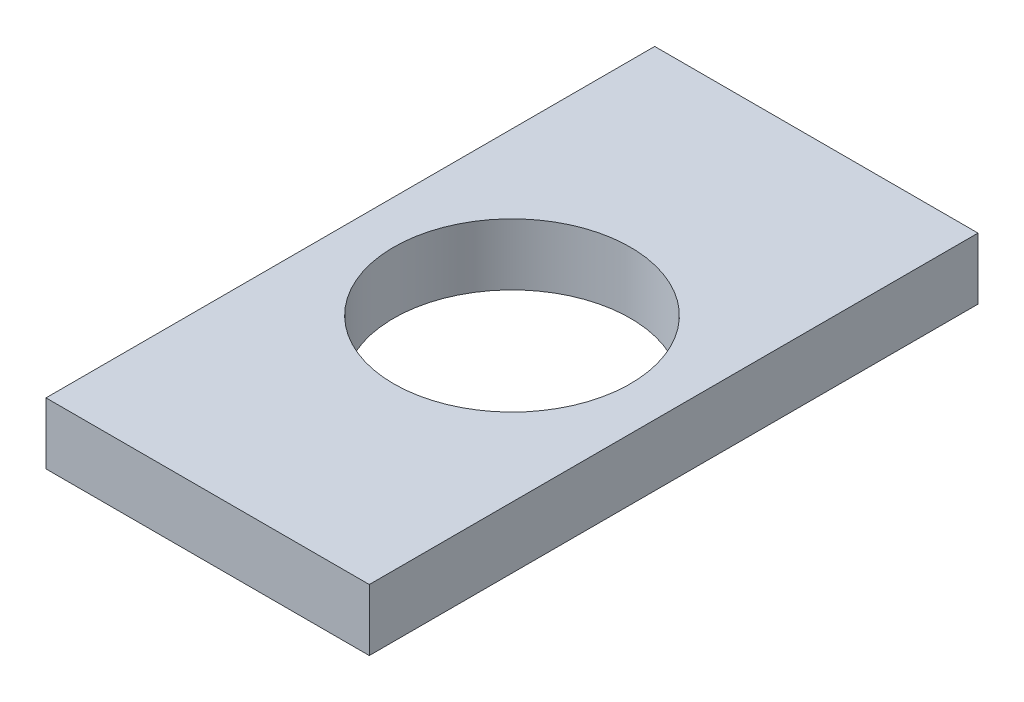
ISO-10303-21;
HEADER;
FILE_DESCRIPTION(('STEP AP214'),'2;1');
FILE_NAME('part.step','',(''),(''),'','','');
FILE_SCHEMA(('AUTOMOTIVE_DESIGN { 1 0 10303 214 1 1 1 1 }'));
ENDSEC;
DATA;
#1=APPLICATION_CONTEXT('core data for automotive mechanical design processes');
#2=APPLICATION_PROTOCOL_DEFINITION('international standard','automotive_design',2000,#1);
#3=PRODUCT_CONTEXT('',#1,'mechanical');
#4=PRODUCT('Part','Part','',(#3));
#5=PRODUCT_RELATED_PRODUCT_CATEGORY('part','',(#4));
#6=PRODUCT_DEFINITION_FORMATION('','',#4);
#7=PRODUCT_DEFINITION_CONTEXT('part definition',#1,'design');
#8=PRODUCT_DEFINITION('design','',#6,#7);
#9=PRODUCT_DEFINITION_SHAPE('','',#8);
#10=(LENGTH_UNIT() NAMED_UNIT(*) SI_UNIT(.MILLI.,.METRE.));
#11=(NAMED_UNIT(*) PLANE_ANGLE_UNIT() SI_UNIT($,.RADIAN.));
#12=(NAMED_UNIT(*) SI_UNIT($,.STERADIAN.) SOLID_ANGLE_UNIT());
#13=UNCERTAINTY_MEASURE_WITH_UNIT(LENGTH_MEASURE(1.E-05),#10,'distance_accuracy_value','');
#14=(GEOMETRIC_REPRESENTATION_CONTEXT(3) GLOBAL_UNCERTAINTY_ASSIGNED_CONTEXT((#13)) GLOBAL_UNIT_ASSIGNED_CONTEXT((#10,
#11,#12)) REPRESENTATION_CONTEXT('',''));
#15=CARTESIAN_POINT('',(0.,0.,0.));
#16=DIRECTION('',(0.,0.,1.));
#17=DIRECTION('',(1.,0.,0.));
#18=AXIS2_PLACEMENT_3D('',#15,#16,#17);
#19=CARTESIAN_POINT('',(0.,9.1,0.));
#20=DIRECTION('',(0.,-1.,0.));
#21=DIRECTION('',(0.,0.,-1.));
#22=AXIS2_PLACEMENT_3D('',#19,#20,#21);
#23=PLANE('',#22);
#24=DIRECTION('',(0.,0.,1.));
#25=VECTOR('',#24,1.);
#26=CARTESIAN_POINT('',(0.,9.1,0.));
#27=LINE('',#26,#25);
#28=CARTESIAN_POINT('',(0.,9.1,-90.));
#29=VERTEX_POINT('',#28);
#30=CARTESIAN_POINT('',(0.,9.1,0.));
#31=VERTEX_POINT('',#30);
#32=EDGE_CURVE('E96',#29,#31,#27,.T.);
#33=ORIENTED_EDGE('',*,*,#32,.T.);
#34=DIRECTION('',(1.,0.,0.));
#35=VECTOR('',#34,1.);
#36=CARTESIAN_POINT('',(0.,9.1,0.));
#37=LINE('',#36,#35);
#38=CARTESIAN_POINT('',(47.8,9.1,0.));
#39=VERTEX_POINT('',#38);
#40=EDGE_CURVE('E91',#31,#39,#37,.T.);
#41=ORIENTED_EDGE('',*,*,#40,.T.);
#42=DIRECTION('',(0.,0.,-1.));
#43=VECTOR('',#42,1.);
#44=CARTESIAN_POINT('',(47.8,9.1,0.));
#45=LINE('',#44,#43);
#46=CARTESIAN_POINT('',(47.8,9.1,-90.));
#47=VERTEX_POINT('',#46);
#48=EDGE_CURVE('E94',#39,#47,#45,.T.);
#49=ORIENTED_EDGE('',*,*,#48,.T.);
#50=DIRECTION('',(-1.,0.,0.));
#51=VECTOR('',#50,1.);
#52=CARTESIAN_POINT('',(0.,9.1,-90.));
#53=LINE('',#52,#51);
#54=EDGE_CURVE('E61',#47,#29,#53,.T.);
#55=ORIENTED_EDGE('',*,*,#54,.T.);
#56=EDGE_LOOP('',(#33,#41,#49,#55));
#57=FACE_BOUND('',#56,.T.);
#58=CARTESIAN_POINT('',(23.9,9.1,-45.));
#59=DIRECTION('',(0.,1.,0.));
#60=DIRECTION('',(0.,0.,1.));
#61=AXIS2_PLACEMENT_3D('',#58,#59,#60);
#62=CIRCLE('',#61,17.5);
#63=CARTESIAN_POINT('',(23.9,9.1,-27.5));
#64=VERTEX_POINT('',#63);
#65=EDGE_CURVE('E116',#64,#64,#62,.T.);
#66=ORIENTED_EDGE('',*,*,#65,.F.);
#67=EDGE_LOOP('',(#66));
#68=FACE_BOUND('',#67,.T.);
#69=ADVANCED_FACE('F43',(#57,#68),#23,.F.);
#70=CARTESIAN_POINT('',(0.,0.,0.));
#71=DIRECTION('',(0.,-1.,0.));
#72=DIRECTION('',(0.,0.,-1.));
#73=AXIS2_PLACEMENT_3D('',#70,#71,#72);
#74=PLANE('',#73);
#75=DIRECTION('',(0.,0.,1.));
#76=VECTOR('',#75,1.);
#77=CARTESIAN_POINT('',(0.,0.,0.));
#78=LINE('',#77,#76);
#79=CARTESIAN_POINT('',(0.,0.,-90.));
#80=VERTEX_POINT('',#79);
#81=CARTESIAN_POINT('',(0.,0.,0.));
#82=VERTEX_POINT('',#81);
#83=EDGE_CURVE('E112',#80,#82,#78,.T.);
#84=ORIENTED_EDGE('',*,*,#83,.F.);
#85=DIRECTION('',(-1.,0.,0.));
#86=VECTOR('',#85,1.);
#87=CARTESIAN_POINT('',(0.,0.,-90.));
#88=LINE('',#87,#86);
#89=CARTESIAN_POINT('',(47.8,0.,-90.));
#90=VERTEX_POINT('',#89);
#91=EDGE_CURVE('E84',#90,#80,#88,.T.);
#92=ORIENTED_EDGE('',*,*,#91,.F.);
#93=DIRECTION('',(0.,0.,-1.));
#94=VECTOR('',#93,1.);
#95=CARTESIAN_POINT('',(47.8,0.,0.));
#96=LINE('',#95,#94);
#97=CARTESIAN_POINT('',(47.8,0.,0.));
#98=VERTEX_POINT('',#97);
#99=EDGE_CURVE('E78',#98,#90,#96,.T.);
#100=ORIENTED_EDGE('',*,*,#99,.F.);
#101=DIRECTION('',(1.,0.,0.));
#102=VECTOR('',#101,1.);
#103=CARTESIAN_POINT('',(0.,0.,0.));
#104=LINE('',#103,#102);
#105=EDGE_CURVE('E101',#82,#98,#104,.T.);
#106=ORIENTED_EDGE('',*,*,#105,.F.);
#107=EDGE_LOOP('',(#84,#92,#100,#106));
#108=FACE_BOUND('',#107,.T.);
#109=CARTESIAN_POINT('',(23.9,0.,-45.));
#110=DIRECTION('',(0.,1.,0.));
#111=DIRECTION('',(0.,0.,1.));
#112=AXIS2_PLACEMENT_3D('',#109,#110,#111);
#113=CIRCLE('',#112,17.5);
#114=CARTESIAN_POINT('',(23.9,0.,-27.5));
#115=VERTEX_POINT('',#114);
#116=EDGE_CURVE('E134',#115,#115,#113,.T.);
#117=ORIENTED_EDGE('',*,*,#116,.T.);
#118=EDGE_LOOP('',(#117));
#119=FACE_BOUND('',#118,.T.);
#120=ADVANCED_FACE('F129',(#108,#119),#74,.T.);
#121=CARTESIAN_POINT('',(0.,9.1,0.));
#122=DIRECTION('',(1.,0.,0.));
#123=DIRECTION('',(0.,0.,-1.));
#124=AXIS2_PLACEMENT_3D('',#121,#122,#123);
#125=PLANE('',#124);
#126=ORIENTED_EDGE('',*,*,#83,.T.);
#127=DIRECTION('',(0.,-1.,0.));
#128=VECTOR('',#127,1.);
#129=CARTESIAN_POINT('',(0.,9.1,0.));
#130=LINE('',#129,#128);
#131=EDGE_CURVE('E11',#31,#82,#130,.T.);
#132=ORIENTED_EDGE('',*,*,#131,.F.);
#133=ORIENTED_EDGE('',*,*,#32,.F.);
#134=DIRECTION('',(0.,-1.,0.));
#135=VECTOR('',#134,1.);
#136=CARTESIAN_POINT('',(0.,9.1,-90.));
#137=LINE('',#136,#135);
#138=EDGE_CURVE('E108',#29,#80,#137,.T.);
#139=ORIENTED_EDGE('',*,*,#138,.T.);
#140=EDGE_LOOP('',(#126,#132,#133,#139));
#141=FACE_BOUND('',#140,.T.);
#142=ADVANCED_FACE('F45',(#141),#125,.F.);
#143=CARTESIAN_POINT('',(0.,9.1,0.));
#144=DIRECTION('',(0.,0.,-1.));
#145=DIRECTION('',(-1.,0.,0.));
#146=AXIS2_PLACEMENT_3D('',#143,#144,#145);
#147=PLANE('',#146);
#148=ORIENTED_EDGE('',*,*,#105,.T.);
#149=DIRECTION('',(0.,-1.,0.));
#150=VECTOR('',#149,1.);
#151=CARTESIAN_POINT('',(47.8,9.1,0.));
#152=LINE('',#151,#150);
#153=EDGE_CURVE('E53',#39,#98,#152,.T.);
#154=ORIENTED_EDGE('',*,*,#153,.F.);
#155=ORIENTED_EDGE('',*,*,#40,.F.);
#156=ORIENTED_EDGE('',*,*,#131,.T.);
#157=EDGE_LOOP('',(#148,#154,#155,#156));
#158=FACE_BOUND('',#157,.T.);
#159=ADVANCED_FACE('F100',(#158),#147,.F.);
#160=CARTESIAN_POINT('',(47.8,9.1,0.));
#161=DIRECTION('',(-1.,0.,0.));
#162=DIRECTION('',(0.,0.,1.));
#163=AXIS2_PLACEMENT_3D('',#160,#161,#162);
#164=PLANE('',#163);
#165=ORIENTED_EDGE('',*,*,#99,.T.);
#166=DIRECTION('',(0.,-1.,0.));
#167=VECTOR('',#166,1.);
#168=CARTESIAN_POINT('',(47.8,9.1,-90.));
#169=LINE('',#168,#167);
#170=EDGE_CURVE('E103',#47,#90,#169,.T.);
#171=ORIENTED_EDGE('',*,*,#170,.F.);
#172=ORIENTED_EDGE('',*,*,#48,.F.);
#173=ORIENTED_EDGE('',*,*,#153,.T.);
#174=EDGE_LOOP('',(#165,#171,#172,#173));
#175=FACE_BOUND('',#174,.T.);
#176=ADVANCED_FACE('F104',(#175),#164,.F.);
#177=CARTESIAN_POINT('',(0.,9.1,-90.));
#178=DIRECTION('',(0.,0.,1.));
#179=DIRECTION('',(1.,0.,0.));
#180=AXIS2_PLACEMENT_3D('',#177,#178,#179);
#181=PLANE('',#180);
#182=ORIENTED_EDGE('',*,*,#91,.T.);
#183=ORIENTED_EDGE('',*,*,#138,.F.);
#184=ORIENTED_EDGE('',*,*,#54,.F.);
#185=ORIENTED_EDGE('',*,*,#170,.T.);
#186=EDGE_LOOP('',(#182,#183,#184,#185));
#187=FACE_BOUND('',#186,.T.);
#188=ADVANCED_FACE('F126',(#187),#181,.F.);
#189=CARTESIAN_POINT('',(23.9,9.1,-45.));
#190=DIRECTION('',(0.,-1.,0.));
#191=DIRECTION('',(0.,0.,-1.));
#192=AXIS2_PLACEMENT_3D('',#189,#190,#191);
#193=CYLINDRICAL_SURFACE('',#192,17.5);
#194=ORIENTED_EDGE('',*,*,#65,.T.);
#195=EDGE_LOOP('',(#194));
#196=FACE_BOUND('',#195,.T.);
#197=ORIENTED_EDGE('',*,*,#116,.F.);
#198=EDGE_LOOP('',(#197));
#199=FACE_BOUND('',#198,.T.);
#200=ADVANCED_FACE('F142',(#196,#199),#193,.F.);
#201=CLOSED_SHELL('',(#69,#120,#142,#159,#176,#188,#200));
#202=MANIFOLD_SOLID_BREP('B2',#201);
#203=ADVANCED_BREP_SHAPE_REPRESENTATION('',(#18,#202),#14);
#204=SHAPE_DEFINITION_REPRESENTATION(#9,#203);
ENDSEC;
END-ISO-10303-21;
